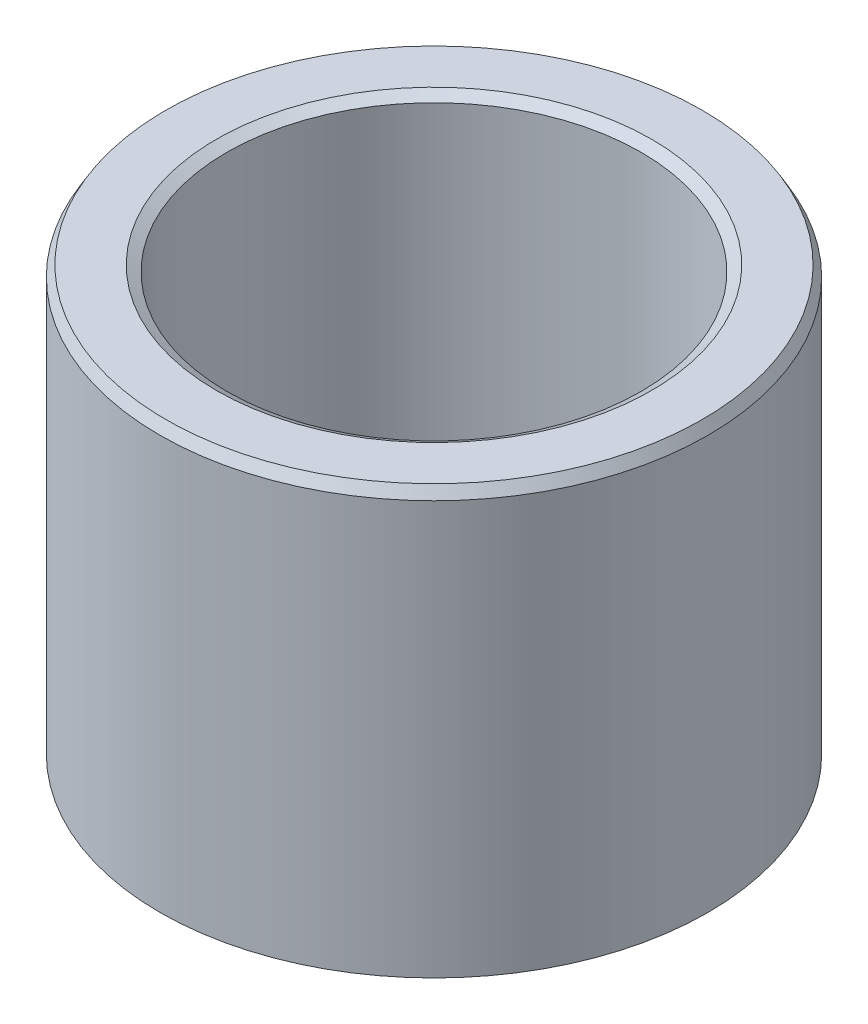
ISO-10303-21;
HEADER;
FILE_DESCRIPTION(('STEP AP214'),'2;1');
FILE_NAME('part.step','',(''),(''),'','','');
FILE_SCHEMA(('AUTOMOTIVE_DESIGN { 1 0 10303 214 1 1 1 1 }'));
ENDSEC;
DATA;
#1=APPLICATION_CONTEXT('core data for automotive mechanical design processes');
#2=APPLICATION_PROTOCOL_DEFINITION('international standard','automotive_design',2000,#1);
#3=PRODUCT_CONTEXT('',#1,'mechanical');
#4=PRODUCT('Part','Part','',(#3));
#5=PRODUCT_RELATED_PRODUCT_CATEGORY('part','',(#4));
#6=PRODUCT_DEFINITION_FORMATION('','',#4);
#7=PRODUCT_DEFINITION_CONTEXT('part definition',#1,'design');
#8=PRODUCT_DEFINITION('design','',#6,#7);
#9=PRODUCT_DEFINITION_SHAPE('','',#8);
#10=(LENGTH_UNIT() NAMED_UNIT(*) SI_UNIT(.MILLI.,.METRE.));
#11=(NAMED_UNIT(*) PLANE_ANGLE_UNIT() SI_UNIT($,.RADIAN.));
#12=(NAMED_UNIT(*) SI_UNIT($,.STERADIAN.) SOLID_ANGLE_UNIT());
#13=UNCERTAINTY_MEASURE_WITH_UNIT(LENGTH_MEASURE(1.E-05),#10,'distance_accuracy_value','');
#14=(GEOMETRIC_REPRESENTATION_CONTEXT(3) GLOBAL_UNCERTAINTY_ASSIGNED_CONTEXT((#13)) GLOBAL_UNIT_ASSIGNED_CONTEXT((#10,
#11,#12)) REPRESENTATION_CONTEXT('',''));
#15=CARTESIAN_POINT('',(0.,0.,0.));
#16=DIRECTION('',(0.,0.,1.));
#17=DIRECTION('',(1.,0.,0.));
#18=AXIS2_PLACEMENT_3D('',#15,#16,#17);
#19=CARTESIAN_POINT('',(0.,62.7171915135494,0.));
#20=DIRECTION('',(0.,-1.,0.));
#21=DIRECTION('',(0.,0.,-1.));
#22=AXIS2_PLACEMENT_3D('',#19,#20,#21);
#23=CYLINDRICAL_SURFACE('',#22,40.);
#24=CARTESIAN_POINT('',(0.,0.882829397782267,0.));
#25=DIRECTION('',(0.,1.,0.));
#26=DIRECTION('',(0.,0.,1.));
#27=AXIS2_PLACEMENT_3D('',#24,#25,#26);
#28=CIRCLE('',#27,40.);
#29=CARTESIAN_POINT('',(0.,0.882829397782267,40.));
#30=VERTEX_POINT('',#29);
#31=EDGE_CURVE('E10',#30,#30,#28,.T.);
#32=ORIENTED_EDGE('',*,*,#31,.T.);
#33=EDGE_LOOP('',(#32));
#34=FACE_BOUND('',#33,.T.);
#35=CARTESIAN_POINT('',(0.,61.188086142175,0.));
#36=DIRECTION('',(0.,1.,0.));
#37=DIRECTION('',(0.,0.,1.));
#38=AXIS2_PLACEMENT_3D('',#35,#36,#37);
#39=CIRCLE('',#38,40.);
#40=CARTESIAN_POINT('',(0.,61.1880861421749,-40.));
#41=VERTEX_POINT('',#40);
#42=EDGE_CURVE('E50',#41,#41,#39,.F.);
#43=ORIENTED_EDGE('',*,*,#42,.T.);
#44=EDGE_LOOP('',(#43));
#45=FACE_BOUND('',#44,.T.);
#46=ADVANCED_FACE('F39',(#34,#45),#23,.T.);
#47=CARTESIAN_POINT('',(0.,62.7171915135494,0.));
#48=DIRECTION('',(0.,1.,0.));
#49=DIRECTION('',(0.,0.,1.));
#50=AXIS2_PLACEMENT_3D('',#47,#48,#49);
#51=PLANE('',#50);
#52=CARTESIAN_POINT('',(0.,62.7171915135494,0.));
#53=DIRECTION('',(0.,1.,0.));
#54=DIRECTION('',(0.,0.,1.));
#55=AXIS2_PLACEMENT_3D('',#52,#53,#54);
#56=CIRCLE('',#55,31.7565365156887);
#57=CARTESIAN_POINT('',(0.,62.7171915135494,31.7565365156887));
#58=VERTEX_POINT('',#57);
#59=EDGE_CURVE('E58',#58,#58,#56,.F.);
#60=ORIENTED_EDGE('',*,*,#59,.T.);
#61=EDGE_LOOP('',(#60));
#62=FACE_BOUND('',#61,.T.);
#63=CARTESIAN_POINT('',(0.,62.7171915135494,0.));
#64=DIRECTION('',(0.,1.,0.));
#65=DIRECTION('',(0.,0.,1.));
#66=AXIS2_PLACEMENT_3D('',#63,#64,#65);
#67=CIRCLE('',#66,39.1171706022177);
#68=CARTESIAN_POINT('',(0.,62.7171915135494,-39.1171706022177));
#69=VERTEX_POINT('',#68);
#70=EDGE_CURVE('E61',#69,#69,#67,.T.);
#71=ORIENTED_EDGE('',*,*,#70,.T.);
#72=EDGE_LOOP('',(#71));
#73=FACE_BOUND('',#72,.T.);
#74=ADVANCED_FACE('F88',(#62,#73),#51,.T.);
#75=CARTESIAN_POINT('',(0.,0.,0.));
#76=DIRECTION('',(0.,1.,0.));
#77=DIRECTION('',(0.,0.,1.));
#78=AXIS2_PLACEMENT_3D('',#75,#76,#77);
#79=PLANE('',#78);
#80=CARTESIAN_POINT('',(0.,0.,0.));
#81=DIRECTION('',(0.,1.,0.));
#82=DIRECTION('',(0.,0.,1.));
#83=AXIS2_PLACEMENT_3D('',#80,#81,#82);
#84=CIRCLE('',#83,31.1102605420966);
#85=CARTESIAN_POINT('',(0.,0.,31.1102605420966));
#86=VERTEX_POINT('',#85);
#87=EDGE_CURVE('E51',#86,#86,#84,.T.);
#88=ORIENTED_EDGE('',*,*,#87,.T.);
#89=EDGE_LOOP('',(#88));
#90=FACE_BOUND('',#89,.T.);
#91=CARTESIAN_POINT('',(0.,0.,0.));
#92=DIRECTION('',(0.,1.,0.));
#93=DIRECTION('',(0.,0.,1.));
#94=AXIS2_PLACEMENT_3D('',#91,#92,#93);
#95=CIRCLE('',#94,38.4708946286257);
#96=CARTESIAN_POINT('',(0.,0.,38.4708946286257));
#97=VERTEX_POINT('',#96);
#98=EDGE_CURVE('E54',#97,#97,#95,.F.);
#99=ORIENTED_EDGE('',*,*,#98,.T.);
#100=EDGE_LOOP('',(#99));
#101=FACE_BOUND('',#100,.T.);
#102=ADVANCED_FACE('F83',(#90,#101),#79,.F.);
#103=CARTESIAN_POINT('',(0.,62.7171915135494,0.));
#104=DIRECTION('',(0.,-1.,0.));
#105=DIRECTION('',(0.,0.,-1.));
#106=AXIS2_PLACEMENT_3D('',#103,#104,#105);
#107=CYLINDRICAL_SURFACE('',#106,30.2274311443143);
#108=CARTESIAN_POINT('',(0.,61.8343621157671,0.));
#109=DIRECTION('',(0.,1.,0.));
#110=DIRECTION('',(0.,0.,1.));
#111=AXIS2_PLACEMENT_3D('',#108,#109,#110);
#112=CIRCLE('',#111,30.2274311443143);
#113=CARTESIAN_POINT('',(0.,61.8343621157671,30.2274311443143));
#114=VERTEX_POINT('',#113);
#115=EDGE_CURVE('E67',#114,#114,#112,.T.);
#116=ORIENTED_EDGE('',*,*,#115,.T.);
#117=EDGE_LOOP('',(#116));
#118=FACE_BOUND('',#117,.T.);
#119=CARTESIAN_POINT('',(0.,1.52910537137438,0.));
#120=DIRECTION('',(0.,1.,0.));
#121=DIRECTION('',(0.,0.,1.));
#122=AXIS2_PLACEMENT_3D('',#119,#120,#121);
#123=CIRCLE('',#122,30.2274311443143);
#124=CARTESIAN_POINT('',(0.,1.52910537137438,30.2274311443143));
#125=VERTEX_POINT('',#124);
#126=EDGE_CURVE('E69',#125,#125,#123,.F.);
#127=ORIENTED_EDGE('',*,*,#126,.T.);
#128=EDGE_LOOP('',(#127));
#129=FACE_BOUND('',#128,.T.);
#130=ADVANCED_FACE('F71',(#118,#129),#107,.F.);
#131=CARTESIAN_POINT('',(0.,61.8343621157671,0.));
#132=DIRECTION('',(0.,1.,0.));
#133=DIRECTION('',(0.,0.,1.));
#134=AXIS2_PLACEMENT_3D('',#131,#132,#133);
#135=CONICAL_SURFACE('',#134,30.2274311443143,1.0471975511966);
#136=ORIENTED_EDGE('',*,*,#59,.F.);
#137=EDGE_LOOP('',(#136));
#138=FACE_BOUND('',#137,.T.);
#139=ORIENTED_EDGE('',*,*,#115,.F.);
#140=EDGE_LOOP('',(#139));
#141=FACE_BOUND('',#140,.T.);
#142=ADVANCED_FACE('F77',(#138,#141),#135,.F.);
#143=CARTESIAN_POINT('',(0.,0.,0.));
#144=DIRECTION('',(0.,-1.,0.));
#145=DIRECTION('',(0.,0.,-1.));
#146=AXIS2_PLACEMENT_3D('',#143,#144,#145);
#147=CONICAL_SURFACE('',#146,31.1102605420966,0.523598775598296);
#148=ORIENTED_EDGE('',*,*,#126,.F.);
#149=EDGE_LOOP('',(#148));
#150=FACE_BOUND('',#149,.T.);
#151=ORIENTED_EDGE('',*,*,#87,.F.);
#152=EDGE_LOOP('',(#151));
#153=FACE_BOUND('',#152,.T.);
#154=ADVANCED_FACE('F73',(#150,#153),#147,.F.);
#155=CARTESIAN_POINT('',(0.,0.882829397782267,0.));
#156=DIRECTION('',(0.,1.,0.));
#157=DIRECTION('',(0.,0.,1.));
#158=AXIS2_PLACEMENT_3D('',#155,#156,#157);
#159=CONICAL_SURFACE('',#158,40.,1.0471975511966);
#160=ORIENTED_EDGE('',*,*,#98,.F.);
#161=EDGE_LOOP('',(#160));
#162=FACE_BOUND('',#161,.T.);
#163=ORIENTED_EDGE('',*,*,#31,.F.);
#164=EDGE_LOOP('',(#163));
#165=FACE_BOUND('',#164,.T.);
#166=ADVANCED_FACE('F76',(#162,#165),#159,.T.);
#167=CARTESIAN_POINT('',(0.,62.7171915135494,0.));
#168=DIRECTION('',(0.,-1.,0.));
#169=DIRECTION('',(0.,0.,-1.));
#170=AXIS2_PLACEMENT_3D('',#167,#168,#169);
#171=CONICAL_SURFACE('',#170,39.1171706022177,0.523598775598285);
#172=CARTESIAN_POINT('',(0.,61.1880861421749,-40.));
#173=CARTESIAN_POINT('',(0.,61.2040143231268,-39.9908038604398));
#174=CARTESIAN_POINT('',(0.,61.2199425040786,-39.9816077208795));
#175=CARTESIAN_POINT('',(0.,61.2517988659822,-39.9632154417591));
#176=CARTESIAN_POINT('',(0.,61.267727046934,-39.9540193021988));
#177=CARTESIAN_POINT('',(0.,61.2995834088377,-39.9356270230784));
#178=CARTESIAN_POINT('',(0.,61.3155115897895,-39.9264308835181));
#179=CARTESIAN_POINT('',(0.,61.3473679516931,-39.9080386043977));
#180=CARTESIAN_POINT('',(0.,61.3632961326449,-39.8988424648375));
#181=CARTESIAN_POINT('',(0.,61.3951524945486,-39.880450185717));
#182=CARTESIAN_POINT('',(0.,61.4110806755004,-39.8712540461568));
#183=CARTESIAN_POINT('',(0.,61.442937037404,-39.8528617670363));
#184=CARTESIAN_POINT('',(0.,61.4588652183558,-39.8436656274761));
#185=CARTESIAN_POINT('',(0.,61.4907215802595,-39.8252733483556));
#186=CARTESIAN_POINT('',(0.,61.5066497612113,-39.8160772087954));
#187=CARTESIAN_POINT('',(0.,61.5385061231149,-39.7976849296749));
#188=CARTESIAN_POINT('',(0.,61.5544343040667,-39.7884887901147));
#189=CARTESIAN_POINT('',(0.,61.5862906659704,-39.7700965109942));
#190=CARTESIAN_POINT('',(0.,61.6022188469222,-39.760900371434));
#191=CARTESIAN_POINT('',(0.,61.6340752088258,-39.7425080923135));
#192=CARTESIAN_POINT('',(0.,61.6500033897776,-39.7333119527533));
#193=CARTESIAN_POINT('',(0.,61.6818597516813,-39.7149196736328));
#194=CARTESIAN_POINT('',(0.,61.6977879326331,-39.7057235340726));
#195=CARTESIAN_POINT('',(0.,61.7296442945367,-39.6873312549521));
#196=CARTESIAN_POINT('',(0.,61.7455724754885,-39.6781351153919));
#197=CARTESIAN_POINT('',(0.,61.7774288373922,-39.6597428362714));
#198=CARTESIAN_POINT('',(0.,61.793357018344,-39.6505466967112));
#199=CARTESIAN_POINT('',(0.,61.8252133802476,-39.6321544175907));
#200=CARTESIAN_POINT('',(0.,61.8411415611994,-39.6229582780305));
#201=CARTESIAN_POINT('',(0.,61.8729979231031,-39.60456599891));
#202=CARTESIAN_POINT('',(0.,61.8889261040549,-39.5953698593498));
#203=CARTESIAN_POINT('',(0.,61.9207824659585,-39.5769775802293));
#204=CARTESIAN_POINT('',(0.,61.9367106469103,-39.5677814406691));
#205=CARTESIAN_POINT('',(0.,61.968567008814,-39.5493891615486));
#206=CARTESIAN_POINT('',(0.,61.9844951897658,-39.5401930219884));
#207=CARTESIAN_POINT('',(0.,62.0163515516694,-39.5218007428679));
#208=CARTESIAN_POINT('',(0.,62.0322797326212,-39.5126046033077));
#209=CARTESIAN_POINT('',(0.,62.0641360945249,-39.4942123241872));
#210=CARTESIAN_POINT('',(0.,62.0800642754767,-39.485016184627));
#211=CARTESIAN_POINT('',(0.,62.1119206373803,-39.4666239055065));
#212=CARTESIAN_POINT('',(0.,62.1278488183321,-39.4574277659463));
#213=CARTESIAN_POINT('',(0.,62.1597051802358,-39.4390354868258));
#214=CARTESIAN_POINT('',(0.,62.1756333611876,-39.4298393472656));
#215=CARTESIAN_POINT('',(0.,62.2074897230912,-39.4114470681451));
#216=CARTESIAN_POINT('',(0.,62.223417904043,-39.4022509285849));
#217=CARTESIAN_POINT('',(0.,62.2552742659467,-39.3838586494645));
#218=CARTESIAN_POINT('',(0.,62.2712024468985,-39.3746625099042));
#219=CARTESIAN_POINT('',(0.,62.3030588088021,-39.3562702307837));
#220=CARTESIAN_POINT('',(0.,62.3189869897539,-39.3470740912235));
#221=CARTESIAN_POINT('',(0.,62.3508433516576,-39.3286818121031));
#222=CARTESIAN_POINT('',(0.,62.3667715326094,-39.3194856725428));
#223=CARTESIAN_POINT('',(0.,62.398627894513,-39.3010933934224));
#224=CARTESIAN_POINT('',(0.,62.4145560754648,-39.2918972538621));
#225=CARTESIAN_POINT('',(0.,62.4464124373685,-39.2735049747417));
#226=CARTESIAN_POINT('',(0.,62.4623406183203,-39.2643088351814));
#227=CARTESIAN_POINT('',(0.,62.4941969802239,-39.245916556061));
#228=CARTESIAN_POINT('',(0.,62.5101251611757,-39.2367204165007));
#229=CARTESIAN_POINT('',(0.,62.5419815230794,-39.2183281373803));
#230=CARTESIAN_POINT('',(0.,62.5579097040312,-39.20913199782));
#231=CARTESIAN_POINT('',(0.,62.5897660659348,-39.1907397186996));
#232=CARTESIAN_POINT('',(0.,62.6056942468866,-39.1815435791393));
#233=CARTESIAN_POINT('',(0.,62.6375506087903,-39.1631513000189));
#234=CARTESIAN_POINT('',(0.,62.6534787897421,-39.1539551604587));
#235=CARTESIAN_POINT('',(0.,62.6853351516457,-39.1355628813382));
#236=CARTESIAN_POINT('',(0.,62.7012633325975,-39.126366741778));
#237=CARTESIAN_POINT('',(0.,62.7171915135494,-39.1171706022177));
#238=B_SPLINE_CURVE_WITH_KNOTS('',3,(#172,#173,#174,#175,#176,#177,#178,#179,#180,#181,#182,
#183,#184,#185,#186,#187,#188,#189,#190,#191,#192,#193,#194,#195,#196,#197,#198,#199,#200,#201,
#202,#203,#204,#205,#206,#207,#208,#209,#210,#211,#212,#213,#214,#215,#216,#217,#218,#219,#220,
#221,#222,#223,#224,#225,#226,#227,#228,#229,#230,#231,#232,#233,#234,#235,#236,#237),
.UNSPECIFIED.,.F.,.F.,(4,2,2,2,2,2,2,2,2,2,2,2,2,2,2,2,2,2,2,2,2,2,2,2,2,2,2,2,2,2,2,2,4),(0.,
0.0551768373613942,0.110353674722788,0.165530512084183,0.220707349445577,0.275884186806971,
0.331061024168365,0.386237861529759,0.441414698891154,0.496591536252548,0.551768373613942,
0.606945210975336,0.66212204833673,0.717298885698124,0.772475723059519,0.827652560420913,
0.882829397782307,0.938006235143701,0.993183072505096,1.04835990986649,1.10353674722788,
1.15871358458928,1.21389042195067,1.26906725931207,1.32424409667346,1.37942093403486,
1.43459777139625,1.48977460875764,1.54495144611904,1.60012828348044,1.65530512084183,
1.71048195820323,1.76565879556462),.UNSPECIFIED.);
#239=EDGE_CURVE('BSEAM45',#41,#69,#238,.T.);
#240=ORIENTED_EDGE('',*,*,#42,.F.);
#241=ORIENTED_EDGE('',*,*,#70,.F.);
#242=ORIENTED_EDGE('',*,*,#239,.T.);
#243=ORIENTED_EDGE('',*,*,#239,.F.);
#244=EDGE_LOOP('',(#240,#242,#241,#243));
#245=FACE_BOUND('',#244,.T.);
#246=ADVANCED_FACE('F45',(#245),#171,.T.);
#247=CLOSED_SHELL('',(#46,#74,#102,#130,#142,#154,#166,#246));
#248=MANIFOLD_SOLID_BREP('B2',#247);
#249=ADVANCED_BREP_SHAPE_REPRESENTATION('',(#18,#248),#14);
#250=SHAPE_DEFINITION_REPRESENTATION(#9,#249);
ENDSEC;
END-ISO-10303-21;
